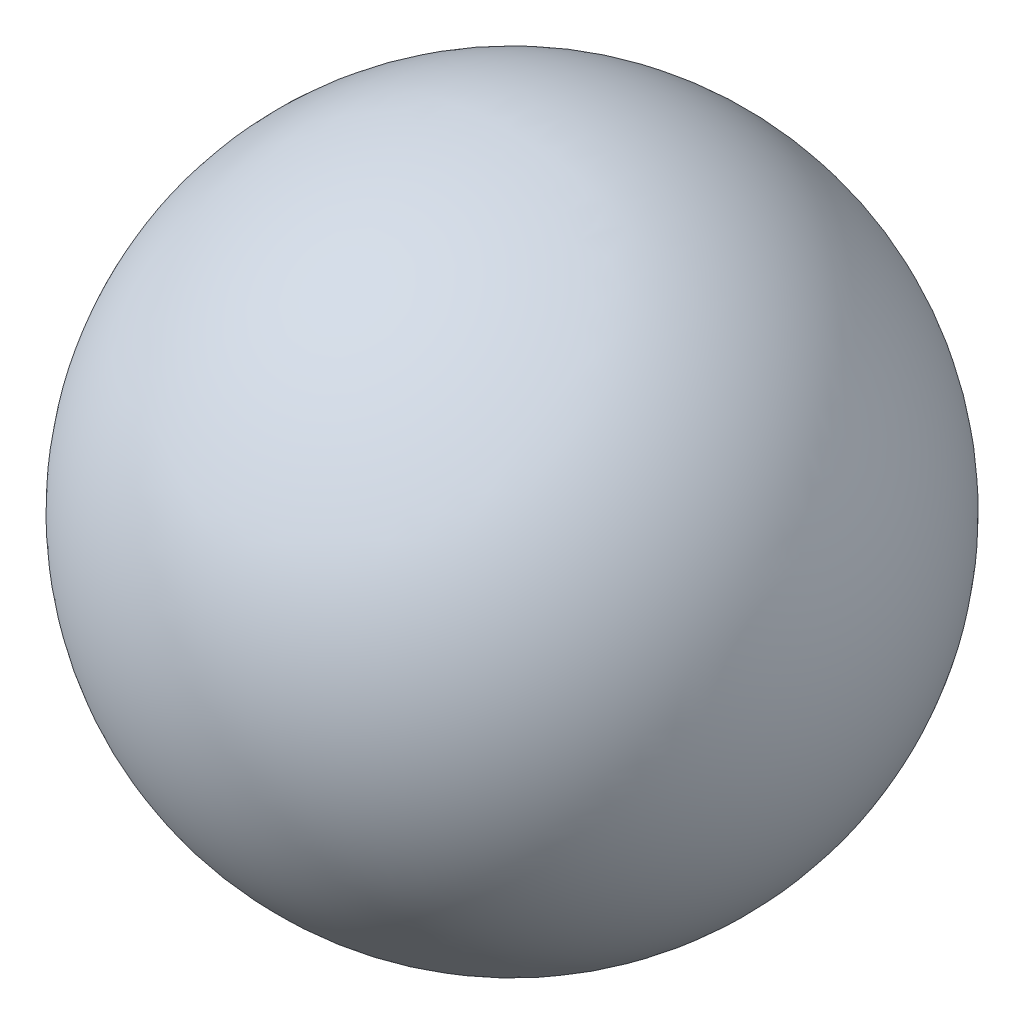
ISO-10303-21;
HEADER;
FILE_DESCRIPTION(('STEP AP214'),'2;1');
FILE_NAME('part.step','',(''),(''),'','','');
FILE_SCHEMA(('AUTOMOTIVE_DESIGN { 1 0 10303 214 1 1 1 1 }'));
ENDSEC;
DATA;
#1=APPLICATION_CONTEXT('core data for automotive mechanical design processes');
#2=APPLICATION_PROTOCOL_DEFINITION('international standard','automotive_design',2000,#1);
#3=PRODUCT_CONTEXT('',#1,'mechanical');
#4=PRODUCT('Part','Part','',(#3));
#5=PRODUCT_RELATED_PRODUCT_CATEGORY('part','',(#4));
#6=PRODUCT_DEFINITION_FORMATION('','',#4);
#7=PRODUCT_DEFINITION_CONTEXT('part definition',#1,'design');
#8=PRODUCT_DEFINITION('design','',#6,#7);
#9=PRODUCT_DEFINITION_SHAPE('','',#8);
#10=(LENGTH_UNIT() NAMED_UNIT(*) SI_UNIT(.MILLI.,.METRE.));
#11=(NAMED_UNIT(*) PLANE_ANGLE_UNIT() SI_UNIT($,.RADIAN.));
#12=(NAMED_UNIT(*) SI_UNIT($,.STERADIAN.) SOLID_ANGLE_UNIT());
#13=UNCERTAINTY_MEASURE_WITH_UNIT(LENGTH_MEASURE(1.E-05),#10,'distance_accuracy_value','');
#14=(GEOMETRIC_REPRESENTATION_CONTEXT(3) GLOBAL_UNCERTAINTY_ASSIGNED_CONTEXT((#13)) GLOBAL_UNIT_ASSIGNED_CONTEXT((#10,
#11,#12)) REPRESENTATION_CONTEXT('',''));
#15=CARTESIAN_POINT('',(0.,0.,0.));
#16=DIRECTION('',(0.,0.,1.));
#17=DIRECTION('',(1.,0.,0.));
#18=AXIS2_PLACEMENT_3D('',#15,#16,#17);
#19=CARTESIAN_POINT('',(0.,0.,0.));
#20=DIRECTION('',(1.,0.,0.));
#21=DIRECTION('',(0.,1.,0.));
#22=AXIS2_PLACEMENT_3D('',#19,#20,#21);
#23=SPHERICAL_SURFACE('',#22,0.11999976);
#24=CARTESIAN_POINT('',(-0.11999976,0.,0.));
#25=VERTEX_POINT('',#24);
#26=VERTEX_LOOP('',#25);
#27=FACE_BOUND('',#26,.T.);
#28=CARTESIAN_POINT('',(0.11999976,0.,0.));
#29=VERTEX_POINT('',#28);
#30=VERTEX_LOOP('',#29);
#31=FACE_BOUND('',#30,.T.);
#32=ADVANCED_FACE('F16',(#27,#31),#23,.T.);
#33=CLOSED_SHELL('',(#32));
#34=MANIFOLD_SOLID_BREP('B1',#33);
#35=ADVANCED_BREP_SHAPE_REPRESENTATION('',(#18,#34),#14);
#36=SHAPE_DEFINITION_REPRESENTATION(#9,#35);
ENDSEC;
END-ISO-10303-21;
